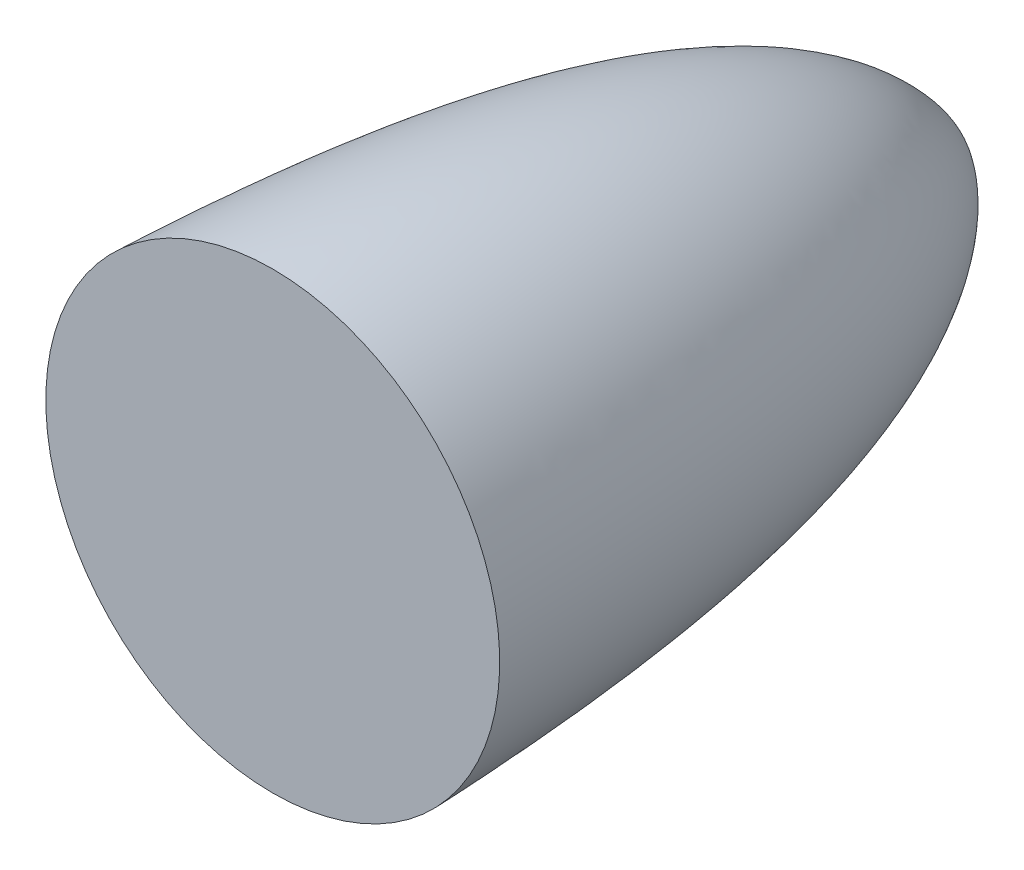
ISO-10303-21;
HEADER;
FILE_DESCRIPTION(('STEP AP214'),'2;1');
FILE_NAME('part.step','',(''),(''),'','','');
FILE_SCHEMA(('AUTOMOTIVE_DESIGN { 1 0 10303 214 1 1 1 1 }'));
ENDSEC;
DATA;
#1=APPLICATION_CONTEXT('core data for automotive mechanical design processes');
#2=APPLICATION_PROTOCOL_DEFINITION('international standard','automotive_design',2000,#1);
#3=PRODUCT_CONTEXT('',#1,'mechanical');
#4=PRODUCT('Part','Part','',(#3));
#5=PRODUCT_RELATED_PRODUCT_CATEGORY('part','',(#4));
#6=PRODUCT_DEFINITION_FORMATION('','',#4);
#7=PRODUCT_DEFINITION_CONTEXT('part definition',#1,'design');
#8=PRODUCT_DEFINITION('design','',#6,#7);
#9=PRODUCT_DEFINITION_SHAPE('','',#8);
#10=(LENGTH_UNIT() NAMED_UNIT(*) SI_UNIT(.MILLI.,.METRE.));
#11=(NAMED_UNIT(*) PLANE_ANGLE_UNIT() SI_UNIT($,.RADIAN.));
#12=(NAMED_UNIT(*) SI_UNIT($,.STERADIAN.) SOLID_ANGLE_UNIT());
#13=UNCERTAINTY_MEASURE_WITH_UNIT(LENGTH_MEASURE(1.E-05),#10,'distance_accuracy_value','');
#14=(GEOMETRIC_REPRESENTATION_CONTEXT(3) GLOBAL_UNCERTAINTY_ASSIGNED_CONTEXT((#13)) GLOBAL_UNIT_ASSIGNED_CONTEXT((#10,
#11,#12)) REPRESENTATION_CONTEXT('',''));
#15=CARTESIAN_POINT('',(0.,0.,0.));
#16=DIRECTION('',(0.,0.,1.));
#17=DIRECTION('',(1.,0.,0.));
#18=AXIS2_PLACEMENT_3D('',#15,#16,#17);
#19=CARTESIAN_POINT('',(0.,0.,-29.9999999999998));
#20=CARTESIAN_POINT('',(0.,3.48790698576125,-28.7890443158059));
#21=CARTESIAN_POINT('',(1.11022302462516E-13,7.67460204107899,-24.5042235951289));
#22=CARTESIAN_POINT('',(0.,9.47357257266086,-14.1683201773133));
#23=CARTESIAN_POINT('',(0.,10.0000000000001,0.));
#24=B_SPLINE_CURVE_WITH_KNOTS('',4,(#19,#20,#21,#22,#23),.UNSPECIFIED.,.F.,.F.,(5,5),(0.,1.),.UNSPECIFIED.);
#25=CARTESIAN_POINT('',(0.,0.,0.));
#26=DIRECTION('',(0.,0.,1.));
#27=AXIS1_PLACEMENT('',#25,#26);
#28=SURFACE_OF_REVOLUTION('',#24,#27);
#29=CARTESIAN_POINT('',(0.,0.,0.));
#30=DIRECTION('',(0.,0.,1.));
#31=DIRECTION('',(0.,-1.00000000000002,0.));
#32=AXIS2_PLACEMENT_3D('',#29,#30,#31);
#33=CIRCLE('',#32,10.);
#34=CARTESIAN_POINT('',(0.,-10.0000000000002,0.));
#35=VERTEX_POINT('',#34);
#36=EDGE_CURVE('E11',#35,#35,#33,.T.);
#37=ORIENTED_EDGE('',*,*,#36,.F.);
#38=EDGE_LOOP('',(#37));
#39=FACE_BOUND('',#38,.T.);
#40=CARTESIAN_POINT('',(0.,0.,-29.9999999999998));
#41=VERTEX_POINT('',#40);
#42=VERTEX_LOOP('',#41);
#43=FACE_BOUND('',#42,.T.);
#44=ADVANCED_FACE('F36',(#39,#43),#28,.T.);
#45=CARTESIAN_POINT('',(0.,10.0000000000001,0.));
#46=DIRECTION('',(0.,0.,-1.));
#47=DIRECTION('',(0.,1.00000000000002,0.));
#48=AXIS2_PLACEMENT_3D('',#45,#46,#47);
#49=PLANE('',#48);
#50=ORIENTED_EDGE('',*,*,#36,.T.);
#51=EDGE_LOOP('',(#50));
#52=FACE_BOUND('',#51,.T.);
#53=ADVANCED_FACE('F45',(#52),#49,.F.);
#54=CLOSED_SHELL('',(#44,#53));
#55=MANIFOLD_SOLID_BREP('B2',#54);
#56=ADVANCED_BREP_SHAPE_REPRESENTATION('',(#18,#55),#14);
#57=SHAPE_DEFINITION_REPRESENTATION(#9,#56);
ENDSEC;
END-ISO-10303-21;
